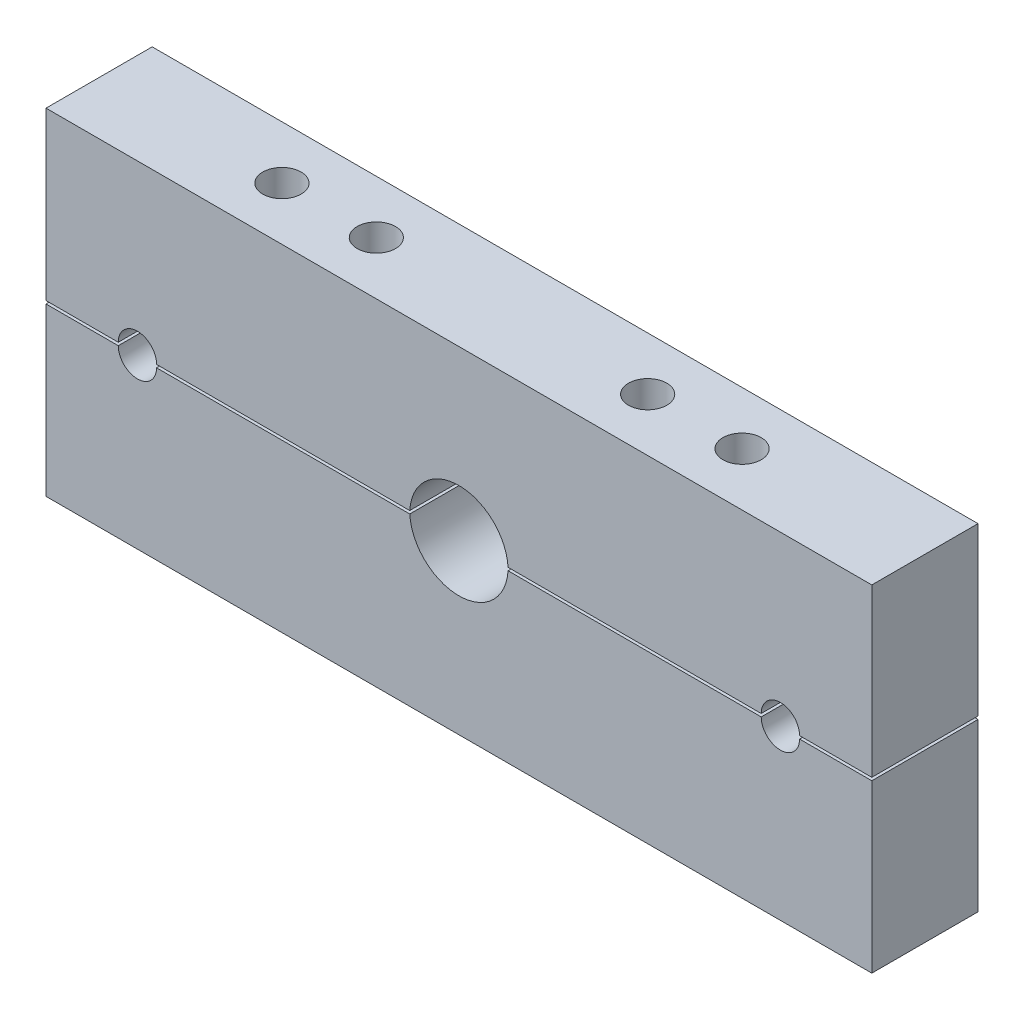
ISO-10303-21;
HEADER;
FILE_DESCRIPTION(('STEP AP214'),'2;1');
FILE_NAME('part.step','',(''),(''),'','','');
FILE_SCHEMA(('AUTOMOTIVE_DESIGN { 1 0 10303 214 1 1 1 1 }'));
ENDSEC;
DATA;
#1=APPLICATION_CONTEXT('core data for automotive mechanical design processes');
#2=APPLICATION_PROTOCOL_DEFINITION('international standard','automotive_design',2000,#1);
#3=PRODUCT_CONTEXT('',#1,'mechanical');
#4=PRODUCT('Part','Part','',(#3));
#5=PRODUCT_RELATED_PRODUCT_CATEGORY('part','',(#4));
#6=PRODUCT_DEFINITION_FORMATION('','',#4);
#7=PRODUCT_DEFINITION_CONTEXT('part definition',#1,'design');
#8=PRODUCT_DEFINITION('design','',#6,#7);
#9=PRODUCT_DEFINITION_SHAPE('','',#8);
#10=(LENGTH_UNIT() NAMED_UNIT(*) SI_UNIT(.MILLI.,.METRE.));
#11=(NAMED_UNIT(*) PLANE_ANGLE_UNIT() SI_UNIT($,.RADIAN.));
#12=(NAMED_UNIT(*) SI_UNIT($,.STERADIAN.) SOLID_ANGLE_UNIT());
#13=UNCERTAINTY_MEASURE_WITH_UNIT(LENGTH_MEASURE(1.E-05),#10,'distance_accuracy_value','');
#14=(GEOMETRIC_REPRESENTATION_CONTEXT(3) GLOBAL_UNCERTAINTY_ASSIGNED_CONTEXT((#13)) GLOBAL_UNIT_ASSIGNED_CONTEXT((#10,
#11,#12)) REPRESENTATION_CONTEXT('',''));
#15=CARTESIAN_POINT('',(0.,0.,0.));
#16=DIRECTION('',(0.,0.,1.));
#17=DIRECTION('',(1.,0.,0.));
#18=AXIS2_PLACEMENT_3D('',#15,#16,#17);
#19=CARTESIAN_POINT('',(267.829500207352,-141.019656459711,0.));
#20=DIRECTION('',(0.,-1.,0.));
#21=DIRECTION('',(1.,0.,0.));
#22=AXIS2_PLACEMENT_3D('',#19,#20,#21);
#23=PLANE('',#22);
#24=DIRECTION('',(0.,0.,1.));
#25=VECTOR('',#24,1.);
#26=CARTESIAN_POINT('',(243.329500207352,-141.019656459711,0.));
#27=LINE('',#26,#25);
#28=CARTESIAN_POINT('',(243.329500207352,-141.019656459711,0.));
#29=VERTEX_POINT('',#28);
#30=CARTESIAN_POINT('',(243.329500207352,-141.019656459711,36.));
#31=VERTEX_POINT('',#30);
#32=EDGE_CURVE('E328',#29,#31,#27,.T.);
#33=ORIENTED_EDGE('',*,*,#32,.F.);
#34=DIRECTION('',(-1.,0.,0.));
#35=VECTOR('',#34,1.);
#36=CARTESIAN_POINT('',(267.829500207352,-141.019656459711,0.));
#37=LINE('',#36,#35);
#38=CARTESIAN_POINT('',(267.829500207352,-141.019656459711,0.));
#39=VERTEX_POINT('',#38);
#40=EDGE_CURVE('E162',#39,#29,#37,.T.);
#41=ORIENTED_EDGE('',*,*,#40,.F.);
#42=DIRECTION('',(0.,0.,1.));
#43=VECTOR('',#42,1.);
#44=CARTESIAN_POINT('',(267.829500207352,-141.019656459711,0.));
#45=LINE('',#44,#43);
#46=CARTESIAN_POINT('',(267.829500207352,-141.019656459711,36.));
#47=VERTEX_POINT('',#46);
#48=EDGE_CURVE('E197',#39,#47,#45,.T.);
#49=ORIENTED_EDGE('',*,*,#48,.T.);
#50=DIRECTION('',(-1.,0.,0.));
#51=VECTOR('',#50,1.);
#52=CARTESIAN_POINT('',(267.829500207352,-141.019656459711,36.));
#53=LINE('',#52,#51);
#54=EDGE_CURVE('E69',#47,#31,#53,.T.);
#55=ORIENTED_EDGE('',*,*,#54,.T.);
#56=EDGE_LOOP('',(#33,#41,#49,#55));
#57=FACE_BOUND('',#56,.T.);
#58=ADVANCED_FACE('F57',(#57),#23,.T.);
#59=DIRECTION('',(0.,0.,1.));
#60=VECTOR('',#59,1.);
#61=CARTESIAN_POINT('',(25.3295002073518,-141.019656459711,0.));
#62=LINE('',#61,#60);
#63=CARTESIAN_POINT('',(25.3295002073518,-141.019656459711,0.));
#64=VERTEX_POINT('',#63);
#65=CARTESIAN_POINT('',(25.3295002073518,-141.019656459711,36.));
#66=VERTEX_POINT('',#65);
#67=EDGE_CURVE('E139',#64,#66,#62,.T.);
#68=ORIENTED_EDGE('',*,*,#67,.F.);
#69=CARTESIAN_POINT('',(111.159467213983,-141.019656459711,0.));
#70=VERTEX_POINT('',#69);
#71=EDGE_CURVE('E149',#70,#64,#37,.T.);
#72=ORIENTED_EDGE('',*,*,#71,.F.);
#73=DIRECTION('',(0.,0.,-1.));
#74=VECTOR('',#73,1.);
#75=CARTESIAN_POINT('',(111.159467213983,-141.019656459711,36.));
#76=LINE('',#75,#74);
#77=CARTESIAN_POINT('',(111.159467213983,-141.019656459711,36.));
#78=VERTEX_POINT('',#77);
#79=EDGE_CURVE('E244',#78,#70,#76,.T.);
#80=ORIENTED_EDGE('',*,*,#79,.F.);
#81=EDGE_CURVE('E12',#78,#66,#53,.T.);
#82=ORIENTED_EDGE('',*,*,#81,.T.);
#83=EDGE_LOOP('',(#68,#72,#80,#82));
#84=FACE_BOUND('',#83,.T.);
#85=CARTESIAN_POINT('',(81.8295002073518,-141.019656459711,18.));
#86=DIRECTION('',(0.,1.,0.));
#87=DIRECTION('',(-1.,0.,0.));
#88=AXIS2_PLACEMENT_3D('',#85,#86,#87);
#89=CIRCLE('',#88,6.5);
#90=CARTESIAN_POINT('',(75.3295002073518,-141.019656459711,18.));
#91=VERTEX_POINT('',#90);
#92=EDGE_CURVE('E211',#91,#91,#89,.F.);
#93=ORIENTED_EDGE('',*,*,#92,.F.);
#94=EDGE_LOOP('',(#93));
#95=FACE_BOUND('',#94,.T.);
#96=CARTESIAN_POINT('',(49.8295002073518,-141.019656459711,18.));
#97=DIRECTION('',(0.,1.,0.));
#98=DIRECTION('',(-1.,0.,0.));
#99=AXIS2_PLACEMENT_3D('',#96,#97,#98);
#100=CIRCLE('',#99,6.5);
#101=CARTESIAN_POINT('',(43.3295002073518,-141.019656459711,18.));
#102=VERTEX_POINT('',#101);
#103=EDGE_CURVE('E248',#102,#102,#100,.F.);
#104=ORIENTED_EDGE('',*,*,#103,.F.);
#105=EDGE_LOOP('',(#104));
#106=FACE_BOUND('',#105,.T.);
#107=ADVANCED_FACE('F147',(#84,#95,#106),#23,.T.);
#108=CARTESIAN_POINT('',(127.829500207352,-142.019656459711,36.));
#109=DIRECTION('',(0.,0.,-1.));
#110=DIRECTION('',(-1.,0.,0.));
#111=AXIS2_PLACEMENT_3D('',#108,#109,#110);
#112=CYLINDRICAL_SURFACE('',#111,16.7);
#113=CARTESIAN_POINT('',(127.829500207352,-142.019656459711,36.));
#114=DIRECTION('',(0.,0.,1.));
#115=DIRECTION('',(1.,0.,0.));
#116=AXIS2_PLACEMENT_3D('',#113,#114,#115);
#117=CIRCLE('',#116,16.7);
#118=CARTESIAN_POINT('',(144.49953320072,-141.019656459711,36.));
#119=VERTEX_POINT('',#118);
#120=EDGE_CURVE('E240',#119,#78,#117,.T.);
#121=ORIENTED_EDGE('',*,*,#120,.T.);
#122=ORIENTED_EDGE('',*,*,#79,.T.);
#123=CARTESIAN_POINT('',(127.829500207352,-142.019656459711,0.));
#124=DIRECTION('',(0.,0.,1.));
#125=DIRECTION('',(1.,0.,0.));
#126=AXIS2_PLACEMENT_3D('',#123,#124,#125);
#127=CIRCLE('',#126,16.7);
#128=CARTESIAN_POINT('',(144.49953320072,-141.019656459711,0.));
#129=VERTEX_POINT('',#128);
#130=EDGE_CURVE('E157',#129,#70,#127,.T.);
#131=ORIENTED_EDGE('',*,*,#130,.F.);
#132=DIRECTION('',(0.,0.,-1.));
#133=VECTOR('',#132,1.);
#134=CARTESIAN_POINT('',(144.49953320072,-141.019656459711,36.));
#135=LINE('',#134,#133);
#136=EDGE_CURVE('E220',#129,#119,#135,.F.);
#137=ORIENTED_EDGE('',*,*,#136,.T.);
#138=EDGE_LOOP('',(#121,#122,#131,#137));
#139=FACE_BOUND('',#138,.T.);
#140=ADVANCED_FACE('F356',(#139),#112,.F.);
#141=CARTESIAN_POINT('',(267.829500207352,0.,36.));
#142=DIRECTION('',(1.,0.,0.));
#143=DIRECTION('',(0.,0.,-1.));
#144=AXIS2_PLACEMENT_3D('',#141,#142,#143);
#145=PLANE('',#144);
#146=DIRECTION('',(0.,-1.,0.));
#147=VECTOR('',#146,1.);
#148=CARTESIAN_POINT('',(267.829500207352,0.,36.));
#149=LINE('',#148,#147);
#150=CARTESIAN_POINT('',(267.829500207352,-84.5196564597115,36.));
#151=VERTEX_POINT('',#150);
#152=EDGE_CURVE('E198',#151,#47,#149,.T.);
#153=ORIENTED_EDGE('',*,*,#152,.T.);
#154=ORIENTED_EDGE('',*,*,#48,.F.);
#155=DIRECTION('',(0.,-1.,0.));
#156=VECTOR('',#155,1.);
#157=CARTESIAN_POINT('',(267.829500207352,0.,0.));
#158=LINE('',#157,#156);
#159=CARTESIAN_POINT('',(267.829500207352,-84.5196564597115,0.));
#160=VERTEX_POINT('',#159);
#161=EDGE_CURVE('E61',#160,#39,#158,.T.);
#162=ORIENTED_EDGE('',*,*,#161,.F.);
#163=DIRECTION('',(0.,0.,-1.));
#164=VECTOR('',#163,1.);
#165=CARTESIAN_POINT('',(267.829500207352,-84.5196564597115,36.));
#166=LINE('',#165,#164);
#167=EDGE_CURVE('E195',#151,#160,#166,.T.);
#168=ORIENTED_EDGE('',*,*,#167,.F.);
#169=EDGE_LOOP('',(#153,#154,#162,#168));
#170=FACE_BOUND('',#169,.T.);
#171=ADVANCED_FACE('F59',(#170),#145,.T.);
#172=CARTESIAN_POINT('',(-12.1704997926482,0.,36.));
#173=DIRECTION('',(1.,0.,0.));
#174=DIRECTION('',(0.,1.,0.));
#175=AXIS2_PLACEMENT_3D('',#172,#173,#174);
#176=PLANE('',#175);
#177=DIRECTION('',(0.,0.,1.));
#178=VECTOR('',#177,1.);
#179=CARTESIAN_POINT('',(-12.1704997926482,-141.019656459711,0.));
#180=LINE('',#179,#178);
#181=CARTESIAN_POINT('',(-12.1704997926482,-141.019656459711,0.));
#182=VERTEX_POINT('',#181);
#183=CARTESIAN_POINT('',(-12.1704997926482,-141.019656459711,36.));
#184=VERTEX_POINT('',#183);
#185=EDGE_CURVE('E214',#182,#184,#180,.T.);
#186=ORIENTED_EDGE('',*,*,#185,.T.);
#187=DIRECTION('',(0.,-1.,0.));
#188=VECTOR('',#187,1.);
#189=CARTESIAN_POINT('',(-12.1704997926482,0.,36.));
#190=LINE('',#189,#188);
#191=CARTESIAN_POINT('',(-12.1704997926482,-84.5196564597115,36.));
#192=VERTEX_POINT('',#191);
#193=EDGE_CURVE('E169',#192,#184,#190,.T.);
#194=ORIENTED_EDGE('',*,*,#193,.F.);
#195=DIRECTION('',(0.,0.,-1.));
#196=VECTOR('',#195,1.);
#197=CARTESIAN_POINT('',(-12.1704997926482,-84.5196564597115,36.));
#198=LINE('',#197,#196);
#199=CARTESIAN_POINT('',(-12.1704997926482,-84.5196564597115,0.));
#200=VERTEX_POINT('',#199);
#201=EDGE_CURVE('E223',#192,#200,#198,.T.);
#202=ORIENTED_EDGE('',*,*,#201,.T.);
#203=DIRECTION('',(0.,-1.,0.));
#204=VECTOR('',#203,1.);
#205=CARTESIAN_POINT('',(-12.1704997926482,0.,0.));
#206=LINE('',#205,#204);
#207=EDGE_CURVE('E218',#200,#182,#206,.T.);
#208=ORIENTED_EDGE('',*,*,#207,.T.);
#209=EDGE_LOOP('',(#186,#194,#202,#208));
#210=FACE_BOUND('',#209,.T.);
#211=ADVANCED_FACE('F282',(#210),#176,.F.);
#212=CARTESIAN_POINT('',(0.,0.,36.));
#213=DIRECTION('',(0.,0.,1.));
#214=DIRECTION('',(1.,0.,0.));
#215=AXIS2_PLACEMENT_3D('',#212,#213,#214);
#216=PLANE('',#215);
#217=CARTESIAN_POINT('',(18.8295002073518,-141.019656459711,36.));
#218=DIRECTION('',(0.,0.,1.));
#219=DIRECTION('',(1.,0.,0.));
#220=AXIS2_PLACEMENT_3D('',#217,#218,#219);
#221=CIRCLE('',#220,6.5);
#222=CARTESIAN_POINT('',(12.3295002073518,-141.019656459711,36.));
#223=VERTEX_POINT('',#222);
#224=EDGE_CURVE('E84',#66,#223,#221,.T.);
#225=ORIENTED_EDGE('',*,*,#224,.F.);
#226=ORIENTED_EDGE('',*,*,#81,.F.);
#227=ORIENTED_EDGE('',*,*,#120,.F.);
#228=CARTESIAN_POINT('',(230.329500207352,-141.019656459711,36.));
#229=VERTEX_POINT('',#228);
#230=EDGE_CURVE('E203',#229,#119,#53,.T.);
#231=ORIENTED_EDGE('',*,*,#230,.F.);
#232=CARTESIAN_POINT('',(236.829500207352,-141.019656459711,36.));
#233=DIRECTION('',(0.,0.,1.));
#234=DIRECTION('',(1.,0.,0.));
#235=AXIS2_PLACEMENT_3D('',#232,#233,#234);
#236=CIRCLE('',#235,6.50000000000001);
#237=EDGE_CURVE('E76',#31,#229,#236,.T.);
#238=ORIENTED_EDGE('',*,*,#237,.F.);
#239=ORIENTED_EDGE('',*,*,#54,.F.);
#240=ORIENTED_EDGE('',*,*,#152,.F.);
#241=DIRECTION('',(1.,0.,0.));
#242=VECTOR('',#241,1.);
#243=CARTESIAN_POINT('',(0.,-84.5196564597115,36.));
#244=LINE('',#243,#242);
#245=EDGE_CURVE('E180',#192,#151,#244,.T.);
#246=ORIENTED_EDGE('',*,*,#245,.F.);
#247=ORIENTED_EDGE('',*,*,#193,.T.);
#248=EDGE_CURVE('E67',#223,#184,#53,.T.);
#249=ORIENTED_EDGE('',*,*,#248,.F.);
#250=EDGE_LOOP('',(#225,#226,#227,#231,#238,#239,#240,#246,#247,#249));
#251=FACE_BOUND('',#250,.T.);
#252=ADVANCED_FACE('F284',(#251),#216,.T.);
#253=CARTESIAN_POINT('',(0.,0.,0.));
#254=DIRECTION('',(0.,0.,1.));
#255=DIRECTION('',(1.,0.,0.));
#256=AXIS2_PLACEMENT_3D('',#253,#254,#255);
#257=PLANE('',#256);
#258=ORIENTED_EDGE('',*,*,#71,.T.);
#259=CARTESIAN_POINT('',(18.8295002073518,-141.019656459711,0.));
#260=DIRECTION('',(0.,0.,1.));
#261=DIRECTION('',(1.,0.,0.));
#262=AXIS2_PLACEMENT_3D('',#259,#260,#261);
#263=CIRCLE('',#262,6.5);
#264=CARTESIAN_POINT('',(12.3295002073518,-141.019656459711,0.));
#265=VERTEX_POINT('',#264);
#266=EDGE_CURVE('E136',#64,#265,#263,.T.);
#267=ORIENTED_EDGE('',*,*,#266,.T.);
#268=EDGE_CURVE('E160',#265,#182,#37,.T.);
#269=ORIENTED_EDGE('',*,*,#268,.T.);
#270=ORIENTED_EDGE('',*,*,#207,.F.);
#271=DIRECTION('',(1.,0.,0.));
#272=VECTOR('',#271,1.);
#273=CARTESIAN_POINT('',(0.,-84.5196564597115,0.));
#274=LINE('',#273,#272);
#275=EDGE_CURVE('E159',#200,#160,#274,.T.);
#276=ORIENTED_EDGE('',*,*,#275,.T.);
#277=ORIENTED_EDGE('',*,*,#161,.T.);
#278=ORIENTED_EDGE('',*,*,#40,.T.);
#279=CARTESIAN_POINT('',(236.829500207352,-141.019656459711,0.));
#280=DIRECTION('',(0.,0.,1.));
#281=DIRECTION('',(1.,0.,0.));
#282=AXIS2_PLACEMENT_3D('',#279,#280,#281);
#283=CIRCLE('',#282,6.50000000000001);
#284=CARTESIAN_POINT('',(230.329500207352,-141.019656459711,0.));
#285=VERTEX_POINT('',#284);
#286=EDGE_CURVE('E333',#29,#285,#283,.T.);
#287=ORIENTED_EDGE('',*,*,#286,.T.);
#288=EDGE_CURVE('E170',#285,#129,#37,.T.);
#289=ORIENTED_EDGE('',*,*,#288,.T.);
#290=ORIENTED_EDGE('',*,*,#130,.T.);
#291=EDGE_LOOP('',(#258,#267,#269,#270,#276,#277,#278,#287,#289,#290));
#292=FACE_BOUND('',#291,.T.);
#293=ADVANCED_FACE('F155',(#292),#257,.F.);
#294=CARTESIAN_POINT('',(0.,-84.5196564597115,36.));
#295=DIRECTION('',(0.,1.,0.));
#296=DIRECTION('',(0.,0.,1.));
#297=AXIS2_PLACEMENT_3D('',#294,#295,#296);
#298=PLANE('',#297);
#299=CARTESIAN_POINT('',(205.829500207352,-84.5196564597115,18.));
#300=DIRECTION('',(0.,1.,0.));
#301=DIRECTION('',(0.,0.,1.));
#302=AXIS2_PLACEMENT_3D('',#299,#300,#301);
#303=CIRCLE('',#302,6.50000000000002);
#304=CARTESIAN_POINT('',(205.829500207352,-84.5196564597115,24.5));
#305=VERTEX_POINT('',#304);
#306=EDGE_CURVE('E256',#305,#305,#303,.T.);
#307=ORIENTED_EDGE('',*,*,#306,.F.);
#308=EDGE_LOOP('',(#307));
#309=FACE_BOUND('',#308,.T.);
#310=CARTESIAN_POINT('',(173.829500207352,-84.5196564597115,18.));
#311=DIRECTION('',(0.,1.,0.));
#312=DIRECTION('',(0.,0.,1.));
#313=AXIS2_PLACEMENT_3D('',#310,#311,#312);
#314=CIRCLE('',#313,6.50000000000002);
#315=CARTESIAN_POINT('',(173.829500207352,-84.5196564597115,24.5));
#316=VERTEX_POINT('',#315);
#317=EDGE_CURVE('E250',#316,#316,#314,.T.);
#318=ORIENTED_EDGE('',*,*,#317,.F.);
#319=EDGE_LOOP('',(#318));
#320=FACE_BOUND('',#319,.T.);
#321=CARTESIAN_POINT('',(81.8295002073518,-84.5196564597115,18.));
#322=DIRECTION('',(0.,1.,0.));
#323=DIRECTION('',(0.,0.,1.));
#324=AXIS2_PLACEMENT_3D('',#321,#322,#323);
#325=CIRCLE('',#324,6.5);
#326=CARTESIAN_POINT('',(81.8295002073518,-84.5196564597115,24.5));
#327=VERTEX_POINT('',#326);
#328=EDGE_CURVE('E204',#327,#327,#325,.T.);
#329=ORIENTED_EDGE('',*,*,#328,.F.);
#330=EDGE_LOOP('',(#329));
#331=FACE_BOUND('',#330,.T.);
#332=CARTESIAN_POINT('',(49.8295002073518,-84.5196564597115,18.));
#333=DIRECTION('',(0.,1.,0.));
#334=DIRECTION('',(0.,0.,1.));
#335=AXIS2_PLACEMENT_3D('',#332,#333,#334);
#336=CIRCLE('',#335,6.5);
#337=CARTESIAN_POINT('',(49.8295002073518,-84.5196564597115,24.5));
#338=VERTEX_POINT('',#337);
#339=EDGE_CURVE('E245',#338,#338,#336,.T.);
#340=ORIENTED_EDGE('',*,*,#339,.F.);
#341=EDGE_LOOP('',(#340));
#342=FACE_BOUND('',#341,.T.);
#343=ORIENTED_EDGE('',*,*,#275,.F.);
#344=ORIENTED_EDGE('',*,*,#201,.F.);
#345=ORIENTED_EDGE('',*,*,#245,.T.);
#346=ORIENTED_EDGE('',*,*,#167,.T.);
#347=EDGE_LOOP('',(#343,#344,#345,#346));
#348=FACE_BOUND('',#347,.T.);
#349=ADVANCED_FACE('F286',(#309,#320,#331,#342,#348),#298,.T.);
#350=CARTESIAN_POINT('',(173.829500207352,-141.519656459711,18.));
#351=DIRECTION('',(0.,1.,0.));
#352=DIRECTION('',(0.,0.,1.));
#353=AXIS2_PLACEMENT_3D('',#350,#351,#352);
#354=CYLINDRICAL_SURFACE('',#353,6.50000000000002);
#355=CARTESIAN_POINT('',(173.829500207352,-141.019656459711,18.));
#356=DIRECTION('',(0.,1.,0.));
#357=DIRECTION('',(-1.,0.,0.));
#358=AXIS2_PLACEMENT_3D('',#355,#356,#357);
#359=CIRCLE('',#358,6.50000000000002);
#360=CARTESIAN_POINT('',(167.329500207352,-141.019656459711,18.));
#361=VERTEX_POINT('',#360);
#362=EDGE_CURVE('E255',#361,#361,#359,.F.);
#363=ORIENTED_EDGE('',*,*,#362,.T.);
#364=EDGE_LOOP('',(#363));
#365=FACE_BOUND('',#364,.T.);
#366=ORIENTED_EDGE('',*,*,#317,.T.);
#367=EDGE_LOOP('',(#366));
#368=FACE_BOUND('',#367,.T.);
#369=ADVANCED_FACE('F368',(#365,#368),#354,.F.);
#370=CARTESIAN_POINT('',(205.829500207352,-141.519656459711,18.));
#371=DIRECTION('',(0.,1.,0.));
#372=DIRECTION('',(0.,0.,1.));
#373=AXIS2_PLACEMENT_3D('',#370,#371,#372);
#374=CYLINDRICAL_SURFACE('',#373,6.50000000000002);
#375=CARTESIAN_POINT('',(205.829500207352,-141.019656459711,18.));
#376=DIRECTION('',(0.,1.,0.));
#377=DIRECTION('',(-1.,0.,0.));
#378=AXIS2_PLACEMENT_3D('',#375,#376,#377);
#379=CIRCLE('',#378,6.50000000000002);
#380=CARTESIAN_POINT('',(199.329500207352,-141.019656459711,18.));
#381=VERTEX_POINT('',#380);
#382=EDGE_CURVE('E254',#381,#381,#379,.F.);
#383=ORIENTED_EDGE('',*,*,#382,.T.);
#384=EDGE_LOOP('',(#383));
#385=FACE_BOUND('',#384,.T.);
#386=ORIENTED_EDGE('',*,*,#306,.T.);
#387=EDGE_LOOP('',(#386));
#388=FACE_BOUND('',#387,.T.);
#389=ADVANCED_FACE('F363',(#385,#388),#374,.F.);
#390=CARTESIAN_POINT('',(49.8295002073518,-141.519656459711,18.));
#391=DIRECTION('',(0.,1.,0.));
#392=DIRECTION('',(0.,0.,1.));
#393=AXIS2_PLACEMENT_3D('',#390,#391,#392);
#394=CYLINDRICAL_SURFACE('',#393,6.5);
#395=ORIENTED_EDGE('',*,*,#103,.T.);
#396=EDGE_LOOP('',(#395));
#397=FACE_BOUND('',#396,.T.);
#398=ORIENTED_EDGE('',*,*,#339,.T.);
#399=EDGE_LOOP('',(#398));
#400=FACE_BOUND('',#399,.T.);
#401=ADVANCED_FACE('F360',(#397,#400),#394,.F.);
#402=CARTESIAN_POINT('',(81.8295002073518,-141.519656459711,18.));
#403=DIRECTION('',(0.,1.,0.));
#404=DIRECTION('',(0.,0.,1.));
#405=AXIS2_PLACEMENT_3D('',#402,#403,#404);
#406=CYLINDRICAL_SURFACE('',#405,6.5);
#407=ORIENTED_EDGE('',*,*,#92,.T.);
#408=EDGE_LOOP('',(#407));
#409=FACE_BOUND('',#408,.T.);
#410=ORIENTED_EDGE('',*,*,#328,.T.);
#411=EDGE_LOOP('',(#410));
#412=FACE_BOUND('',#411,.T.);
#413=ADVANCED_FACE('F352',(#409,#412),#406,.F.);
#414=DIRECTION('',(0.,0.,1.));
#415=VECTOR('',#414,1.);
#416=CARTESIAN_POINT('',(230.329500207352,-141.019656459711,0.));
#417=LINE('',#416,#415);
#418=EDGE_CURVE('E323',#285,#229,#417,.T.);
#419=ORIENTED_EDGE('',*,*,#418,.T.);
#420=ORIENTED_EDGE('',*,*,#230,.T.);
#421=ORIENTED_EDGE('',*,*,#136,.F.);
#422=ORIENTED_EDGE('',*,*,#288,.F.);
#423=EDGE_LOOP('',(#419,#420,#421,#422));
#424=FACE_BOUND('',#423,.T.);
#425=ORIENTED_EDGE('',*,*,#382,.F.);
#426=EDGE_LOOP('',(#425));
#427=FACE_BOUND('',#426,.T.);
#428=ORIENTED_EDGE('',*,*,#362,.F.);
#429=EDGE_LOOP('',(#428));
#430=FACE_BOUND('',#429,.T.);
#431=ADVANCED_FACE('F382',(#424,#427,#430),#23,.T.);
#432=DIRECTION('',(0.,0.,1.));
#433=VECTOR('',#432,1.);
#434=CARTESIAN_POINT('',(12.3295002073518,-141.019656459711,0.));
#435=LINE('',#434,#433);
#436=EDGE_CURVE('E140',#265,#223,#435,.T.);
#437=ORIENTED_EDGE('',*,*,#436,.T.);
#438=ORIENTED_EDGE('',*,*,#248,.T.);
#439=ORIENTED_EDGE('',*,*,#185,.F.);
#440=ORIENTED_EDGE('',*,*,#268,.F.);
#441=EDGE_LOOP('',(#437,#438,#439,#440));
#442=FACE_BOUND('',#441,.T.);
#443=ADVANCED_FACE('F280',(#442),#23,.T.);
#444=CARTESIAN_POINT('',(18.8295002073518,-141.019656459711,0.));
#445=DIRECTION('',(0.,0.,1.));
#446=DIRECTION('',(1.,0.,0.));
#447=AXIS2_PLACEMENT_3D('',#444,#445,#446);
#448=CYLINDRICAL_SURFACE('',#447,6.5);
#449=ORIENTED_EDGE('',*,*,#224,.T.);
#450=ORIENTED_EDGE('',*,*,#436,.F.);
#451=ORIENTED_EDGE('',*,*,#266,.F.);
#452=ORIENTED_EDGE('',*,*,#67,.T.);
#453=EDGE_LOOP('',(#449,#450,#451,#452));
#454=FACE_BOUND('',#453,.T.);
#455=ADVANCED_FACE('F138',(#454),#448,.F.);
#456=CARTESIAN_POINT('',(236.829500207352,-141.019656459711,0.));
#457=DIRECTION('',(0.,0.,1.));
#458=DIRECTION('',(1.,0.,0.));
#459=AXIS2_PLACEMENT_3D('',#456,#457,#458);
#460=CYLINDRICAL_SURFACE('',#459,6.50000000000001);
#461=ORIENTED_EDGE('',*,*,#237,.T.);
#462=ORIENTED_EDGE('',*,*,#418,.F.);
#463=ORIENTED_EDGE('',*,*,#286,.F.);
#464=ORIENTED_EDGE('',*,*,#32,.T.);
#465=EDGE_LOOP('',(#461,#462,#463,#464));
#466=FACE_BOUND('',#465,.T.);
#467=ADVANCED_FACE('F470',(#466),#460,.F.);
#468=CLOSED_SHELL('',(#58,#107,#140,#171,#211,#252,#293,#349,#369,#389,#401,#413,#431,#443,#455,#467));
#469=MANIFOLD_SOLID_BREP('B2',#468);
#470=CARTESIAN_POINT('',(267.829500207352,-142.019656459711,0.));
#471=DIRECTION('',(0.,-1.,0.));
#472=DIRECTION('',(1.,0.,0.));
#473=AXIS2_PLACEMENT_3D('',#470,#471,#472);
#474=PLANE('',#473);
#475=CARTESIAN_POINT('',(81.8295002073518,-142.019656459711,18.));
#476=DIRECTION('',(0.,-1.,0.));
#477=DIRECTION('',(1.,0.,0.));
#478=AXIS2_PLACEMENT_3D('',#475,#476,#477);
#479=CIRCLE('',#478,6.5);
#480=CARTESIAN_POINT('',(88.3295002073518,-142.019656459711,18.));
#481=VERTEX_POINT('',#480);
#482=EDGE_CURVE('E598',#481,#481,#479,.T.);
#483=ORIENTED_EDGE('',*,*,#482,.T.);
#484=EDGE_LOOP('',(#483));
#485=FACE_BOUND('',#484,.T.);
#486=CARTESIAN_POINT('',(49.8295002073518,-142.019656459711,18.));
#487=DIRECTION('',(0.,-1.,0.));
#488=DIRECTION('',(1.,0.,0.));
#489=AXIS2_PLACEMENT_3D('',#486,#487,#488);
#490=CIRCLE('',#489,6.5);
#491=CARTESIAN_POINT('',(56.3295002073518,-142.019656459711,18.));
#492=VERTEX_POINT('',#491);
#493=EDGE_CURVE('E730',#492,#492,#490,.T.);
#494=ORIENTED_EDGE('',*,*,#493,.T.);
#495=EDGE_LOOP('',(#494));
#496=FACE_BOUND('',#495,.T.);
#497=DIRECTION('',(-1.,0.,0.));
#498=VECTOR('',#497,1.);
#499=CARTESIAN_POINT('',(267.829500207352,-142.019656459711,0.));
#500=LINE('',#499,#498);
#501=CARTESIAN_POINT('',(111.159467213983,-142.019656459711,0.));
#502=VERTEX_POINT('',#501);
#503=CARTESIAN_POINT('',(25.3295002073518,-142.019656459711,0.));
#504=VERTEX_POINT('',#503);
#505=EDGE_CURVE('E687',#502,#504,#500,.T.);
#506=ORIENTED_EDGE('',*,*,#505,.T.);
#507=DIRECTION('',(0.,0.,1.));
#508=VECTOR('',#507,1.);
#509=CARTESIAN_POINT('',(25.3295002073518,-142.019656459711,0.));
#510=LINE('',#509,#508);
#511=CARTESIAN_POINT('',(25.3295002073518,-142.019656459711,36.));
#512=VERTEX_POINT('',#511);
#513=EDGE_CURVE('E671',#504,#512,#510,.T.);
#514=ORIENTED_EDGE('',*,*,#513,.T.);
#515=DIRECTION('',(-1.,0.,0.));
#516=VECTOR('',#515,1.);
#517=CARTESIAN_POINT('',(267.829500207352,-142.019656459711,36.));
#518=LINE('',#517,#516);
#519=CARTESIAN_POINT('',(111.159467213983,-142.019656459711,36.));
#520=VERTEX_POINT('',#519);
#521=EDGE_CURVE('E713',#520,#512,#518,.T.);
#522=ORIENTED_EDGE('',*,*,#521,.F.);
#523=DIRECTION('',(0.,0.,-1.));
#524=VECTOR('',#523,1.);
#525=CARTESIAN_POINT('',(111.159467213983,-142.019656459711,36.));
#526=LINE('',#525,#524);
#527=EDGE_CURVE('E694',#502,#520,#526,.F.);
#528=ORIENTED_EDGE('',*,*,#527,.F.);
#529=EDGE_LOOP('',(#506,#514,#522,#528));
#530=FACE_BOUND('',#529,.T.);
#531=ADVANCED_FACE('F594',(#485,#496,#530),#474,.F.);
#532=CARTESIAN_POINT('',(267.829500207352,-142.019656459711,0.));
#533=VERTEX_POINT('',#532);
#534=CARTESIAN_POINT('',(243.329500207352,-142.019656459711,0.));
#535=VERTEX_POINT('',#534);
#536=EDGE_CURVE('E698',#533,#535,#500,.T.);
#537=ORIENTED_EDGE('',*,*,#536,.T.);
#538=DIRECTION('',(0.,0.,1.));
#539=VECTOR('',#538,1.);
#540=CARTESIAN_POINT('',(243.329500207352,-142.019656459711,0.));
#541=LINE('',#540,#539);
#542=CARTESIAN_POINT('',(243.329500207352,-142.019656459711,36.));
#543=VERTEX_POINT('',#542);
#544=EDGE_CURVE('E853',#535,#543,#541,.T.);
#545=ORIENTED_EDGE('',*,*,#544,.T.);
#546=CARTESIAN_POINT('',(267.829500207352,-142.019656459711,36.));
#547=VERTEX_POINT('',#546);
#548=EDGE_CURVE('E715',#547,#543,#518,.T.);
#549=ORIENTED_EDGE('',*,*,#548,.F.);
#550=DIRECTION('',(0.,0.,1.));
#551=VECTOR('',#550,1.);
#552=CARTESIAN_POINT('',(267.829500207352,-142.019656459711,0.));
#553=LINE('',#552,#551);
#554=EDGE_CURVE('E702',#533,#547,#553,.T.);
#555=ORIENTED_EDGE('',*,*,#554,.F.);
#556=EDGE_LOOP('',(#537,#545,#549,#555));
#557=FACE_BOUND('',#556,.T.);
#558=ADVANCED_FACE('F824',(#557),#474,.F.);
#559=CARTESIAN_POINT('',(0.,-198.519656459711,36.));
#560=DIRECTION('',(0.,1.,0.));
#561=DIRECTION('',(-1.,0.,0.));
#562=AXIS2_PLACEMENT_3D('',#559,#560,#561);
#563=PLANE('',#562);
#564=CARTESIAN_POINT('',(205.829500207352,-198.519656459711,18.));
#565=DIRECTION('',(0.,1.,0.));
#566=DIRECTION('',(0.,0.,1.));
#567=AXIS2_PLACEMENT_3D('',#564,#565,#566);
#568=CIRCLE('',#567,6.50000000000002);
#569=CARTESIAN_POINT('',(205.829500207352,-198.519656459711,24.5));
#570=VERTEX_POINT('',#569);
#571=EDGE_CURVE('E755',#570,#570,#568,.T.);
#572=ORIENTED_EDGE('',*,*,#571,.T.);
#573=EDGE_LOOP('',(#572));
#574=FACE_BOUND('',#573,.T.);
#575=CARTESIAN_POINT('',(173.829500207352,-198.519656459711,18.));
#576=DIRECTION('',(0.,1.,0.));
#577=DIRECTION('',(0.,0.,1.));
#578=AXIS2_PLACEMENT_3D('',#575,#576,#577);
#579=CIRCLE('',#578,6.50000000000002);
#580=CARTESIAN_POINT('',(173.829500207352,-198.519656459711,24.5));
#581=VERTEX_POINT('',#580);
#582=EDGE_CURVE('E760',#581,#581,#579,.T.);
#583=ORIENTED_EDGE('',*,*,#582,.T.);
#584=EDGE_LOOP('',(#583));
#585=FACE_BOUND('',#584,.T.);
#586=CARTESIAN_POINT('',(81.8295002073518,-198.519656459711,18.));
#587=DIRECTION('',(0.,1.,0.));
#588=DIRECTION('',(0.,0.,1.));
#589=AXIS2_PLACEMENT_3D('',#586,#587,#588);
#590=CIRCLE('',#589,6.5);
#591=CARTESIAN_POINT('',(81.8295002073518,-198.519656459711,24.5));
#592=VERTEX_POINT('',#591);
#593=EDGE_CURVE('E764',#592,#592,#590,.T.);
#594=ORIENTED_EDGE('',*,*,#593,.T.);
#595=EDGE_LOOP('',(#594));
#596=FACE_BOUND('',#595,.T.);
#597=CARTESIAN_POINT('',(49.8295002073518,-198.519656459711,18.));
#598=DIRECTION('',(0.,1.,0.));
#599=DIRECTION('',(0.,0.,1.));
#600=AXIS2_PLACEMENT_3D('',#597,#598,#599);
#601=CIRCLE('',#600,6.5);
#602=CARTESIAN_POINT('',(49.8295002073518,-198.519656459711,24.5));
#603=VERTEX_POINT('',#602);
#604=EDGE_CURVE('E754',#603,#603,#601,.T.);
#605=ORIENTED_EDGE('',*,*,#604,.T.);
#606=EDGE_LOOP('',(#605));
#607=FACE_BOUND('',#606,.T.);
#608=DIRECTION('',(1.,0.,0.));
#609=VECTOR('',#608,1.);
#610=CARTESIAN_POINT('',(0.,-198.519656459711,0.));
#611=LINE('',#610,#609);
#612=CARTESIAN_POINT('',(-12.1704997926482,-198.519656459711,0.));
#613=VERTEX_POINT('',#612);
#614=CARTESIAN_POINT('',(267.829500207352,-198.519656459711,0.));
#615=VERTEX_POINT('',#614);
#616=EDGE_CURVE('E776',#613,#615,#611,.T.);
#617=ORIENTED_EDGE('',*,*,#616,.T.);
#618=DIRECTION('',(0.,0.,-1.));
#619=VECTOR('',#618,1.);
#620=CARTESIAN_POINT('',(267.829500207352,-198.519656459711,36.));
#621=LINE('',#620,#619);
#622=CARTESIAN_POINT('',(267.829500207352,-198.519656459711,36.));
#623=VERTEX_POINT('',#622);
#624=EDGE_CURVE('E780',#623,#615,#621,.T.);
#625=ORIENTED_EDGE('',*,*,#624,.F.);
#626=DIRECTION('',(1.,0.,0.));
#627=VECTOR('',#626,1.);
#628=CARTESIAN_POINT('',(0.,-198.519656459711,36.));
#629=LINE('',#628,#627);
#630=CARTESIAN_POINT('',(-12.1704997926482,-198.519656459711,36.));
#631=VERTEX_POINT('',#630);
#632=EDGE_CURVE('E775',#631,#623,#629,.T.);
#633=ORIENTED_EDGE('',*,*,#632,.F.);
#634=DIRECTION('',(0.,0.,-1.));
#635=VECTOR('',#634,1.);
#636=CARTESIAN_POINT('',(-12.1704997926482,-198.519656459711,36.));
#637=LINE('',#636,#635);
#638=EDGE_CURVE('E789',#631,#613,#637,.T.);
#639=ORIENTED_EDGE('',*,*,#638,.T.);
#640=EDGE_LOOP('',(#617,#625,#633,#639));
#641=FACE_BOUND('',#640,.T.);
#642=ADVANCED_FACE('F808',(#574,#585,#596,#607,#641),#563,.F.);
#643=CARTESIAN_POINT('',(127.829500207352,-141.019656459711,36.));
#644=DIRECTION('',(0.,0.,-1.));
#645=DIRECTION('',(-1.,0.,0.));
#646=AXIS2_PLACEMENT_3D('',#643,#644,#645);
#647=CYLINDRICAL_SURFACE('',#646,16.7);
#648=CARTESIAN_POINT('',(127.829500207352,-141.019656459711,0.));
#649=DIRECTION('',(0.,0.,-1.));
#650=DIRECTION('',(1.,0.,0.));
#651=AXIS2_PLACEMENT_3D('',#648,#649,#650);
#652=CIRCLE('',#651,16.7);
#653=CARTESIAN_POINT('',(144.49953320072,-142.019656459711,0.));
#654=VERTEX_POINT('',#653);
#655=EDGE_CURVE('E759',#654,#502,#652,.T.);
#656=ORIENTED_EDGE('',*,*,#655,.T.);
#657=ORIENTED_EDGE('',*,*,#527,.T.);
#658=CARTESIAN_POINT('',(127.829500207352,-141.019656459711,36.));
#659=DIRECTION('',(0.,0.,-1.));
#660=DIRECTION('',(1.,0.,0.));
#661=AXIS2_PLACEMENT_3D('',#658,#659,#660);
#662=CIRCLE('',#661,16.7);
#663=CARTESIAN_POINT('',(144.49953320072,-142.019656459711,36.));
#664=VERTEX_POINT('',#663);
#665=EDGE_CURVE('E771',#664,#520,#662,.T.);
#666=ORIENTED_EDGE('',*,*,#665,.F.);
#667=DIRECTION('',(0.,0.,-1.));
#668=VECTOR('',#667,1.);
#669=CARTESIAN_POINT('',(144.49953320072,-142.019656459711,36.));
#670=LINE('',#669,#668);
#671=EDGE_CURVE('E748',#664,#654,#670,.T.);
#672=ORIENTED_EDGE('',*,*,#671,.T.);
#673=EDGE_LOOP('',(#656,#657,#666,#672));
#674=FACE_BOUND('',#673,.T.);
#675=ADVANCED_FACE('F820',(#674),#647,.F.);
#676=CARTESIAN_POINT('',(0.,0.,0.));
#677=DIRECTION('',(0.,0.,1.));
#678=DIRECTION('',(1.,0.,0.));
#679=AXIS2_PLACEMENT_3D('',#676,#677,#678);
#680=PLANE('',#679);
#681=CARTESIAN_POINT('',(12.3295002073518,-142.019656459711,0.));
#682=VERTEX_POINT('',#681);
#683=CARTESIAN_POINT('',(-12.1704997926482,-142.019656459711,0.));
#684=VERTEX_POINT('',#683);
#685=EDGE_CURVE('E690',#682,#684,#500,.T.);
#686=ORIENTED_EDGE('',*,*,#685,.F.);
#687=CARTESIAN_POINT('',(18.8295002073518,-142.019656459711,0.));
#688=DIRECTION('',(0.,0.,1.));
#689=DIRECTION('',(1.,0.,0.));
#690=AXIS2_PLACEMENT_3D('',#687,#688,#689);
#691=CIRCLE('',#690,6.5);
#692=EDGE_CURVE('E612',#682,#504,#691,.T.);
#693=ORIENTED_EDGE('',*,*,#692,.T.);
#694=ORIENTED_EDGE('',*,*,#505,.F.);
#695=ORIENTED_EDGE('',*,*,#655,.F.);
#696=CARTESIAN_POINT('',(230.329500207352,-142.019656459711,0.));
#697=VERTEX_POINT('',#696);
#698=EDGE_CURVE('E696',#697,#654,#500,.T.);
#699=ORIENTED_EDGE('',*,*,#698,.F.);
#700=CARTESIAN_POINT('',(236.829500207352,-142.019656459711,0.));
#701=DIRECTION('',(0.,0.,1.));
#702=DIRECTION('',(1.,0.,0.));
#703=AXIS2_PLACEMENT_3D('',#700,#701,#702);
#704=CIRCLE('',#703,6.50000000000001);
#705=EDGE_CURVE('E620',#697,#535,#704,.T.);
#706=ORIENTED_EDGE('',*,*,#705,.T.);
#707=ORIENTED_EDGE('',*,*,#536,.F.);
#708=DIRECTION('',(0.,-1.,0.));
#709=VECTOR('',#708,1.);
#710=CARTESIAN_POINT('',(267.829500207352,0.,0.));
#711=LINE('',#710,#709);
#712=EDGE_CURVE('E793',#533,#615,#711,.T.);
#713=ORIENTED_EDGE('',*,*,#712,.T.);
#714=ORIENTED_EDGE('',*,*,#616,.F.);
#715=DIRECTION('',(0.,-1.,0.));
#716=VECTOR('',#715,1.);
#717=CARTESIAN_POINT('',(-12.1704997926482,0.,0.));
#718=LINE('',#717,#716);
#719=EDGE_CURVE('E795',#684,#613,#718,.T.);
#720=ORIENTED_EDGE('',*,*,#719,.F.);
#721=EDGE_LOOP('',(#686,#693,#694,#695,#699,#706,#707,#713,#714,#720));
#722=FACE_BOUND('',#721,.T.);
#723=ADVANCED_FACE('F685',(#722),#680,.F.);
#724=CARTESIAN_POINT('',(0.,0.,36.));
#725=DIRECTION('',(0.,0.,1.));
#726=DIRECTION('',(1.,0.,0.));
#727=AXIS2_PLACEMENT_3D('',#724,#725,#726);
#728=PLANE('',#727);
#729=CARTESIAN_POINT('',(18.8295002073518,-142.019656459711,36.));
#730=DIRECTION('',(0.,0.,1.));
#731=DIRECTION('',(1.,0.,0.));
#732=AXIS2_PLACEMENT_3D('',#729,#730,#731);
#733=CIRCLE('',#732,6.5);
#734=CARTESIAN_POINT('',(12.3295002073518,-142.019656459711,36.));
#735=VERTEX_POINT('',#734);
#736=EDGE_CURVE('E674',#735,#512,#733,.T.);
#737=ORIENTED_EDGE('',*,*,#736,.F.);
#738=CARTESIAN_POINT('',(-12.1704997926482,-142.019656459711,36.));
#739=VERTEX_POINT('',#738);
#740=EDGE_CURVE('E707',#735,#739,#518,.T.);
#741=ORIENTED_EDGE('',*,*,#740,.T.);
#742=DIRECTION('',(0.,-1.,0.));
#743=VECTOR('',#742,1.);
#744=CARTESIAN_POINT('',(-12.1704997926482,0.,36.));
#745=LINE('',#744,#743);
#746=EDGE_CURVE('E55',#739,#631,#745,.T.);
#747=ORIENTED_EDGE('',*,*,#746,.T.);
#748=ORIENTED_EDGE('',*,*,#632,.T.);
#749=DIRECTION('',(0.,-1.,0.));
#750=VECTOR('',#749,1.);
#751=CARTESIAN_POINT('',(267.829500207352,0.,36.));
#752=LINE('',#751,#750);
#753=EDGE_CURVE('E604',#547,#623,#752,.T.);
#754=ORIENTED_EDGE('',*,*,#753,.F.);
#755=ORIENTED_EDGE('',*,*,#548,.T.);
#756=CARTESIAN_POINT('',(236.829500207352,-142.019656459711,36.));
#757=DIRECTION('',(0.,0.,1.));
#758=DIRECTION('',(1.,0.,0.));
#759=AXIS2_PLACEMENT_3D('',#756,#757,#758);
#760=CIRCLE('',#759,6.50000000000001);
#761=CARTESIAN_POINT('',(230.329500207352,-142.019656459711,36.));
#762=VERTEX_POINT('',#761);
#763=EDGE_CURVE('E856',#762,#543,#760,.T.);
#764=ORIENTED_EDGE('',*,*,#763,.F.);
#765=EDGE_CURVE('E714',#762,#664,#518,.T.);
#766=ORIENTED_EDGE('',*,*,#765,.T.);
#767=ORIENTED_EDGE('',*,*,#665,.T.);
#768=ORIENTED_EDGE('',*,*,#521,.T.);
#769=EDGE_LOOP('',(#737,#741,#747,#748,#754,#755,#764,#766,#767,#768));
#770=FACE_BOUND('',#769,.T.);
#771=ADVANCED_FACE('F813',(#770),#728,.T.);
#772=CARTESIAN_POINT('',(-12.1704997926482,0.,36.));
#773=DIRECTION('',(1.,0.,0.));
#774=DIRECTION('',(0.,1.,0.));
#775=AXIS2_PLACEMENT_3D('',#772,#773,#774);
#776=PLANE('',#775);
#777=ORIENTED_EDGE('',*,*,#746,.F.);
#778=DIRECTION('',(0.,0.,1.));
#779=VECTOR('',#778,1.);
#780=CARTESIAN_POINT('',(-12.1704997926482,-142.019656459711,0.));
#781=LINE('',#780,#779);
#782=EDGE_CURVE('E679',#684,#739,#781,.T.);
#783=ORIENTED_EDGE('',*,*,#782,.F.);
#784=ORIENTED_EDGE('',*,*,#719,.T.);
#785=ORIENTED_EDGE('',*,*,#638,.F.);
#786=EDGE_LOOP('',(#777,#783,#784,#785));
#787=FACE_BOUND('',#786,.T.);
#788=ADVANCED_FACE('F804',(#787),#776,.F.);
#789=CARTESIAN_POINT('',(267.829500207352,0.,36.));
#790=DIRECTION('',(1.,0.,0.));
#791=DIRECTION('',(0.,0.,-1.));
#792=AXIS2_PLACEMENT_3D('',#789,#790,#791);
#793=PLANE('',#792);
#794=ORIENTED_EDGE('',*,*,#554,.T.);
#795=ORIENTED_EDGE('',*,*,#753,.T.);
#796=ORIENTED_EDGE('',*,*,#624,.T.);
#797=ORIENTED_EDGE('',*,*,#712,.F.);
#798=EDGE_LOOP('',(#794,#795,#796,#797));
#799=FACE_BOUND('',#798,.T.);
#800=ADVANCED_FACE('F596',(#799),#793,.T.);
#801=CARTESIAN_POINT('',(173.829500207352,-141.519656459711,18.));
#802=DIRECTION('',(0.,-1.,0.));
#803=DIRECTION('',(1.,0.,0.));
#804=AXIS2_PLACEMENT_3D('',#801,#802,#803);
#805=CYLINDRICAL_SURFACE('',#804,6.50000000000002);
#806=CARTESIAN_POINT('',(173.829500207352,-142.019656459711,18.));
#807=DIRECTION('',(0.,-1.,0.));
#808=DIRECTION('',(1.,0.,0.));
#809=AXIS2_PLACEMENT_3D('',#806,#807,#808);
#810=CIRCLE('',#809,6.50000000000002);
#811=CARTESIAN_POINT('',(180.329500207352,-142.019656459711,18.));
#812=VERTEX_POINT('',#811);
#813=EDGE_CURVE('E742',#812,#812,#810,.T.);
#814=ORIENTED_EDGE('',*,*,#813,.F.);
#815=EDGE_LOOP('',(#814));
#816=FACE_BOUND('',#815,.T.);
#817=ORIENTED_EDGE('',*,*,#582,.F.);
#818=EDGE_LOOP('',(#817));
#819=FACE_BOUND('',#818,.T.);
#820=ADVANCED_FACE('F954',(#816,#819),#805,.F.);
#821=CARTESIAN_POINT('',(205.829500207352,-141.519656459711,18.));
#822=DIRECTION('',(0.,-1.,0.));
#823=DIRECTION('',(1.,0.,0.));
#824=AXIS2_PLACEMENT_3D('',#821,#822,#823);
#825=CYLINDRICAL_SURFACE('',#824,6.50000000000002);
#826=CARTESIAN_POINT('',(205.829500207352,-142.019656459711,18.));
#827=DIRECTION('',(0.,-1.,0.));
#828=DIRECTION('',(1.,0.,0.));
#829=AXIS2_PLACEMENT_3D('',#826,#827,#828);
#830=CIRCLE('',#829,6.50000000000002);
#831=CARTESIAN_POINT('',(212.329500207352,-142.019656459711,18.));
#832=VERTEX_POINT('',#831);
#833=EDGE_CURVE('E736',#832,#832,#830,.T.);
#834=ORIENTED_EDGE('',*,*,#833,.F.);
#835=EDGE_LOOP('',(#834));
#836=FACE_BOUND('',#835,.T.);
#837=ORIENTED_EDGE('',*,*,#571,.F.);
#838=EDGE_LOOP('',(#837));
#839=FACE_BOUND('',#838,.T.);
#840=ADVANCED_FACE('F943',(#836,#839),#825,.F.);
#841=CARTESIAN_POINT('',(49.8295002073518,-141.519656459711,18.));
#842=DIRECTION('',(0.,-1.,0.));
#843=DIRECTION('',(1.,0.,0.));
#844=AXIS2_PLACEMENT_3D('',#841,#842,#843);
#845=CYLINDRICAL_SURFACE('',#844,6.5);
#846=ORIENTED_EDGE('',*,*,#493,.F.);
#847=EDGE_LOOP('',(#846));
#848=FACE_BOUND('',#847,.T.);
#849=ORIENTED_EDGE('',*,*,#604,.F.);
#850=EDGE_LOOP('',(#849));
#851=FACE_BOUND('',#850,.T.);
#852=ADVANCED_FACE('F842',(#848,#851),#845,.F.);
#853=CARTESIAN_POINT('',(81.8295002073518,-141.519656459711,18.));
#854=DIRECTION('',(0.,-1.,0.));
#855=DIRECTION('',(1.,0.,0.));
#856=AXIS2_PLACEMENT_3D('',#853,#854,#855);
#857=CYLINDRICAL_SURFACE('',#856,6.5);
#858=ORIENTED_EDGE('',*,*,#482,.F.);
#859=EDGE_LOOP('',(#858));
#860=FACE_BOUND('',#859,.T.);
#861=ORIENTED_EDGE('',*,*,#593,.F.);
#862=EDGE_LOOP('',(#861));
#863=FACE_BOUND('',#862,.T.);
#864=ADVANCED_FACE('F834',(#860,#863),#857,.F.);
#865=ORIENTED_EDGE('',*,*,#740,.F.);
#866=DIRECTION('',(0.,0.,1.));
#867=VECTOR('',#866,1.);
#868=CARTESIAN_POINT('',(12.3295002073518,-142.019656459711,0.));
#869=LINE('',#868,#867);
#870=EDGE_CURVE('E680',#682,#735,#869,.T.);
#871=ORIENTED_EDGE('',*,*,#870,.F.);
#872=ORIENTED_EDGE('',*,*,#685,.T.);
#873=ORIENTED_EDGE('',*,*,#782,.T.);
#874=EDGE_LOOP('',(#865,#871,#872,#873));
#875=FACE_BOUND('',#874,.T.);
#876=ADVANCED_FACE('F826',(#875),#474,.F.);
#877=ORIENTED_EDGE('',*,*,#833,.T.);
#878=EDGE_LOOP('',(#877));
#879=FACE_BOUND('',#878,.T.);
#880=ORIENTED_EDGE('',*,*,#813,.T.);
#881=EDGE_LOOP('',(#880));
#882=FACE_BOUND('',#881,.T.);
#883=ORIENTED_EDGE('',*,*,#765,.F.);
#884=DIRECTION('',(0.,0.,1.));
#885=VECTOR('',#884,1.);
#886=CARTESIAN_POINT('',(230.329500207352,-142.019656459711,0.));
#887=LINE('',#886,#885);
#888=EDGE_CURVE('E850',#697,#762,#887,.T.);
#889=ORIENTED_EDGE('',*,*,#888,.F.);
#890=ORIENTED_EDGE('',*,*,#698,.T.);
#891=ORIENTED_EDGE('',*,*,#671,.F.);
#892=EDGE_LOOP('',(#883,#889,#890,#891));
#893=FACE_BOUND('',#892,.T.);
#894=ADVANCED_FACE('F830',(#879,#882,#893),#474,.F.);
#895=CARTESIAN_POINT('',(236.829500207352,-142.019656459711,0.));
#896=DIRECTION('',(0.,0.,1.));
#897=DIRECTION('',(1.,0.,0.));
#898=AXIS2_PLACEMENT_3D('',#895,#896,#897);
#899=CYLINDRICAL_SURFACE('',#898,6.50000000000001);
#900=ORIENTED_EDGE('',*,*,#763,.T.);
#901=ORIENTED_EDGE('',*,*,#544,.F.);
#902=ORIENTED_EDGE('',*,*,#705,.F.);
#903=ORIENTED_EDGE('',*,*,#888,.T.);
#904=EDGE_LOOP('',(#900,#901,#902,#903));
#905=FACE_BOUND('',#904,.T.);
#906=ADVANCED_FACE('F840',(#905),#899,.F.);
#907=CARTESIAN_POINT('',(18.8295002073518,-142.019656459711,0.));
#908=DIRECTION('',(0.,0.,1.));
#909=DIRECTION('',(1.,0.,0.));
#910=AXIS2_PLACEMENT_3D('',#907,#908,#909);
#911=CYLINDRICAL_SURFACE('',#910,6.5);
#912=ORIENTED_EDGE('',*,*,#736,.T.);
#913=ORIENTED_EDGE('',*,*,#513,.F.);
#914=ORIENTED_EDGE('',*,*,#692,.F.);
#915=ORIENTED_EDGE('',*,*,#870,.T.);
#916=EDGE_LOOP('',(#912,#913,#914,#915));
#917=FACE_BOUND('',#916,.T.);
#918=ADVANCED_FACE('F672',(#917),#911,.F.);
#919=CLOSED_SHELL('',(#531,#558,#642,#675,#723,#771,#788,#800,#820,#840,#852,#864,#876,#894,
#906,#918));
#920=MANIFOLD_SOLID_BREP('B6',#919);
#921=ADVANCED_BREP_SHAPE_REPRESENTATION('',(#18,#469,#920),#14);
#922=SHAPE_DEFINITION_REPRESENTATION(#9,#921);
ENDSEC;
END-ISO-10303-21;
